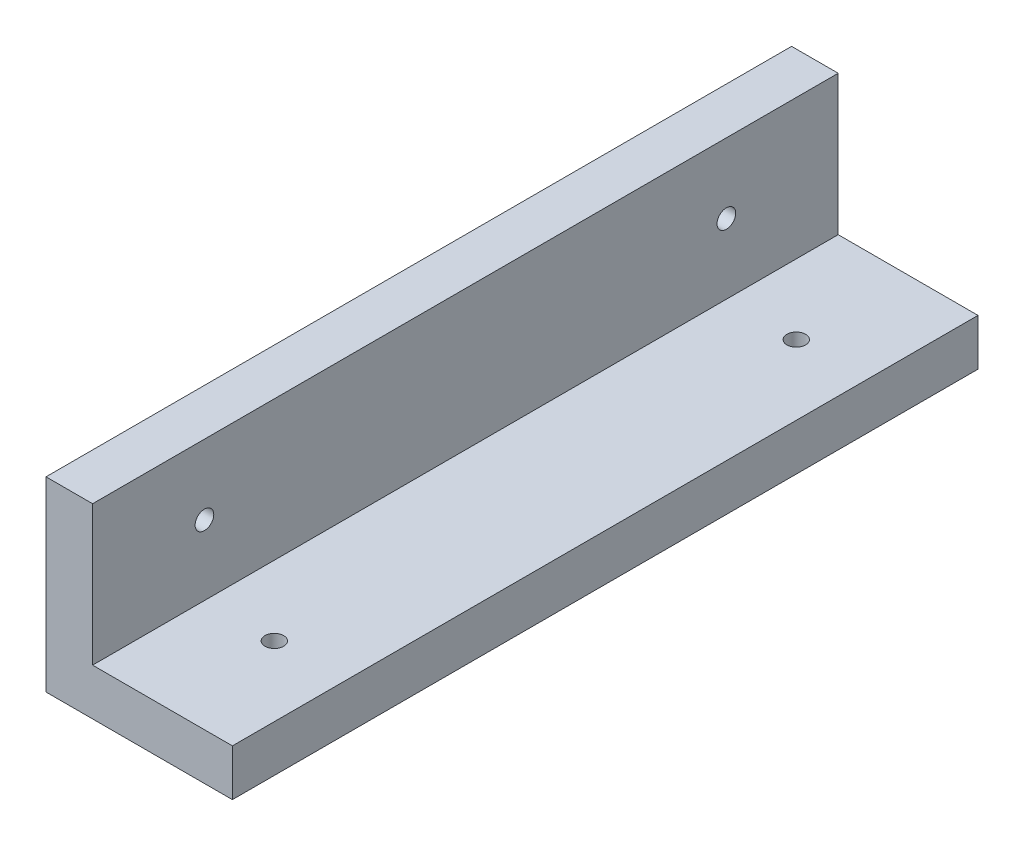
ISO-10303-21;
HEADER;
FILE_DESCRIPTION(('STEP AP214'),'2;1');
FILE_NAME('part.step','',(''),(''),'','','');
FILE_SCHEMA(('AUTOMOTIVE_DESIGN { 1 0 10303 214 1 1 1 1 }'));
ENDSEC;
DATA;
#1=APPLICATION_CONTEXT('core data for automotive mechanical design processes');
#2=APPLICATION_PROTOCOL_DEFINITION('international standard','automotive_design',2000,#1);
#3=PRODUCT_CONTEXT('',#1,'mechanical');
#4=PRODUCT('Part','Part','',(#3));
#5=PRODUCT_RELATED_PRODUCT_CATEGORY('part','',(#4));
#6=PRODUCT_DEFINITION_FORMATION('','',#4);
#7=PRODUCT_DEFINITION_CONTEXT('part definition',#1,'design');
#8=PRODUCT_DEFINITION('design','',#6,#7);
#9=PRODUCT_DEFINITION_SHAPE('','',#8);
#10=(LENGTH_UNIT() NAMED_UNIT(*) SI_UNIT(.MILLI.,.METRE.));
#11=(NAMED_UNIT(*) PLANE_ANGLE_UNIT() SI_UNIT($,.RADIAN.));
#12=(NAMED_UNIT(*) SI_UNIT($,.STERADIAN.) SOLID_ANGLE_UNIT());
#13=UNCERTAINTY_MEASURE_WITH_UNIT(LENGTH_MEASURE(1.E-05),#10,'distance_accuracy_value','');
#14=(GEOMETRIC_REPRESENTATION_CONTEXT(3) GLOBAL_UNCERTAINTY_ASSIGNED_CONTEXT((#13)) GLOBAL_UNIT_ASSIGNED_CONTEXT((#10,
#11,#12)) REPRESENTATION_CONTEXT('',''));
#15=CARTESIAN_POINT('',(0.,0.,0.));
#16=DIRECTION('',(0.,0.,1.));
#17=DIRECTION('',(1.,0.,0.));
#18=AXIS2_PLACEMENT_3D('',#15,#16,#17);
#19=CARTESIAN_POINT('',(5.,20.,80.));
#20=DIRECTION('',(-1.,0.,0.));
#21=DIRECTION('',(0.,-1.,0.));
#22=AXIS2_PLACEMENT_3D('',#19,#20,#21);
#23=PLANE('',#22);
#24=CARTESIAN_POINT('',(5.,12.5,12.));
#25=DIRECTION('',(-1.,0.,0.));
#26=DIRECTION('',(0.,-1.,0.));
#27=AXIS2_PLACEMENT_3D('',#24,#25,#26);
#28=CIRCLE('',#27,1.);
#29=CARTESIAN_POINT('',(5.,11.5,12.));
#30=VERTEX_POINT('',#29);
#31=EDGE_CURVE('E143',#30,#30,#28,.F.);
#32=ORIENTED_EDGE('',*,*,#31,.F.);
#33=EDGE_LOOP('',(#32));
#34=FACE_BOUND('',#33,.T.);
#35=DIRECTION('',(0.,1.,0.));
#36=VECTOR('',#35,1.);
#37=CARTESIAN_POINT('',(5.,20.,0.));
#38=LINE('',#37,#36);
#39=CARTESIAN_POINT('',(5.,5.,0.));
#40=VERTEX_POINT('',#39);
#41=CARTESIAN_POINT('',(5.,20.,0.));
#42=VERTEX_POINT('',#41);
#43=EDGE_CURVE('E110',#40,#42,#38,.T.);
#44=ORIENTED_EDGE('',*,*,#43,.T.);
#45=DIRECTION('',(0.,0.,-1.));
#46=VECTOR('',#45,1.);
#47=CARTESIAN_POINT('',(5.,20.,80.));
#48=LINE('',#47,#46);
#49=CARTESIAN_POINT('',(5.,20.,80.));
#50=VERTEX_POINT('',#49);
#51=EDGE_CURVE('E107',#50,#42,#48,.T.);
#52=ORIENTED_EDGE('',*,*,#51,.F.);
#53=DIRECTION('',(0.,1.,0.));
#54=VECTOR('',#53,1.);
#55=CARTESIAN_POINT('',(5.,20.,80.));
#56=LINE('',#55,#54);
#57=CARTESIAN_POINT('',(5.,5.,80.));
#58=VERTEX_POINT('',#57);
#59=EDGE_CURVE('E96',#58,#50,#56,.T.);
#60=ORIENTED_EDGE('',*,*,#59,.F.);
#61=DIRECTION('',(0.,0.,-1.));
#62=VECTOR('',#61,1.);
#63=CARTESIAN_POINT('',(5.,5.,80.));
#64=LINE('',#63,#62);
#65=EDGE_CURVE('E111',#58,#40,#64,.T.);
#66=ORIENTED_EDGE('',*,*,#65,.T.);
#67=EDGE_LOOP('',(#44,#52,#60,#66));
#68=FACE_BOUND('',#67,.T.);
#69=CARTESIAN_POINT('',(5.,12.5,68.));
#70=DIRECTION('',(-1.,0.,0.));
#71=DIRECTION('',(0.,-1.,0.));
#72=AXIS2_PLACEMENT_3D('',#69,#70,#71);
#73=CIRCLE('',#72,0.999999999999998);
#74=CARTESIAN_POINT('',(5.,11.5,68.));
#75=VERTEX_POINT('',#74);
#76=EDGE_CURVE('E146',#75,#75,#73,.F.);
#77=ORIENTED_EDGE('',*,*,#76,.F.);
#78=EDGE_LOOP('',(#77));
#79=FACE_BOUND('',#78,.T.);
#80=ADVANCED_FACE('F33',(#34,#68,#79),#23,.F.);
#81=CARTESIAN_POINT('',(0.,0.,80.));
#82=DIRECTION('',(1.,0.,0.));
#83=DIRECTION('',(0.,0.,-1.));
#84=AXIS2_PLACEMENT_3D('',#81,#82,#83);
#85=PLANE('',#84);
#86=CARTESIAN_POINT('',(0.,12.5,12.));
#87=DIRECTION('',(1.,0.,0.));
#88=DIRECTION('',(0.,0.,-1.));
#89=AXIS2_PLACEMENT_3D('',#86,#87,#88);
#90=CIRCLE('',#89,1.);
#91=CARTESIAN_POINT('',(0.,12.5,11.));
#92=VERTEX_POINT('',#91);
#93=EDGE_CURVE('E144',#92,#92,#90,.F.);
#94=ORIENTED_EDGE('',*,*,#93,.F.);
#95=EDGE_LOOP('',(#94));
#96=FACE_BOUND('',#95,.T.);
#97=DIRECTION('',(0.,-1.,0.));
#98=VECTOR('',#97,1.);
#99=CARTESIAN_POINT('',(0.,0.,0.));
#100=LINE('',#99,#98);
#101=CARTESIAN_POINT('',(0.,20.,0.));
#102=VERTEX_POINT('',#101);
#103=CARTESIAN_POINT('',(0.,0.,0.));
#104=VERTEX_POINT('',#103);
#105=EDGE_CURVE('E81',#102,#104,#100,.T.);
#106=ORIENTED_EDGE('',*,*,#105,.T.);
#107=DIRECTION('',(0.,0.,-1.));
#108=VECTOR('',#107,1.);
#109=CARTESIAN_POINT('',(0.,0.,80.));
#110=LINE('',#109,#108);
#111=CARTESIAN_POINT('',(0.,0.,80.));
#112=VERTEX_POINT('',#111);
#113=EDGE_CURVE('E116',#112,#104,#110,.T.);
#114=ORIENTED_EDGE('',*,*,#113,.F.);
#115=DIRECTION('',(0.,-1.,0.));
#116=VECTOR('',#115,1.);
#117=CARTESIAN_POINT('',(0.,0.,80.));
#118=LINE('',#117,#116);
#119=CARTESIAN_POINT('',(0.,20.,80.));
#120=VERTEX_POINT('',#119);
#121=EDGE_CURVE('E52',#120,#112,#118,.T.);
#122=ORIENTED_EDGE('',*,*,#121,.F.);
#123=DIRECTION('',(0.,0.,-1.));
#124=VECTOR('',#123,1.);
#125=CARTESIAN_POINT('',(0.,20.,80.));
#126=LINE('',#125,#124);
#127=EDGE_CURVE('E112',#120,#102,#126,.T.);
#128=ORIENTED_EDGE('',*,*,#127,.T.);
#129=EDGE_LOOP('',(#106,#114,#122,#128));
#130=FACE_BOUND('',#129,.T.);
#131=CARTESIAN_POINT('',(0.,12.5,68.));
#132=DIRECTION('',(1.,0.,0.));
#133=DIRECTION('',(0.,0.,-1.));
#134=AXIS2_PLACEMENT_3D('',#131,#132,#133);
#135=CIRCLE('',#134,0.999999999999998);
#136=CARTESIAN_POINT('',(0.,12.5,67.));
#137=VERTEX_POINT('',#136);
#138=EDGE_CURVE('E37',#137,#137,#135,.F.);
#139=ORIENTED_EDGE('',*,*,#138,.F.);
#140=EDGE_LOOP('',(#139));
#141=FACE_BOUND('',#140,.T.);
#142=ADVANCED_FACE('F174',(#96,#130,#141),#85,.F.);
#143=CARTESIAN_POINT('',(0.,0.,80.));
#144=DIRECTION('',(0.,1.,0.));
#145=DIRECTION('',(0.,0.,1.));
#146=AXIS2_PLACEMENT_3D('',#143,#144,#145);
#147=PLANE('',#146);
#148=CARTESIAN_POINT('',(12.5,0.,12.));
#149=DIRECTION('',(0.,1.,0.));
#150=DIRECTION('',(0.,0.,1.));
#151=AXIS2_PLACEMENT_3D('',#148,#149,#150);
#152=CIRCLE('',#151,1.);
#153=CARTESIAN_POINT('',(12.5,0.,13.));
#154=VERTEX_POINT('',#153);
#155=EDGE_CURVE('E124',#154,#154,#152,.F.);
#156=ORIENTED_EDGE('',*,*,#155,.F.);
#157=EDGE_LOOP('',(#156));
#158=FACE_BOUND('',#157,.T.);
#159=DIRECTION('',(1.,0.,0.));
#160=VECTOR('',#159,1.);
#161=CARTESIAN_POINT('',(0.,0.,0.));
#162=LINE('',#161,#160);
#163=CARTESIAN_POINT('',(20.,0.,0.));
#164=VERTEX_POINT('',#163);
#165=EDGE_CURVE('E120',#104,#164,#162,.T.);
#166=ORIENTED_EDGE('',*,*,#165,.T.);
#167=DIRECTION('',(0.,0.,-1.));
#168=VECTOR('',#167,1.);
#169=CARTESIAN_POINT('',(20.,0.,80.));
#170=LINE('',#169,#168);
#171=CARTESIAN_POINT('',(20.,0.,80.));
#172=VERTEX_POINT('',#171);
#173=EDGE_CURVE('E11',#172,#164,#170,.T.);
#174=ORIENTED_EDGE('',*,*,#173,.F.);
#175=DIRECTION('',(1.,0.,0.));
#176=VECTOR('',#175,1.);
#177=CARTESIAN_POINT('',(0.,0.,80.));
#178=LINE('',#177,#176);
#179=EDGE_CURVE('E131',#112,#172,#178,.T.);
#180=ORIENTED_EDGE('',*,*,#179,.F.);
#181=ORIENTED_EDGE('',*,*,#113,.T.);
#182=EDGE_LOOP('',(#166,#174,#180,#181));
#183=FACE_BOUND('',#182,.T.);
#184=CARTESIAN_POINT('',(12.5,0.,68.));
#185=DIRECTION('',(0.,1.,0.));
#186=DIRECTION('',(0.,0.,1.));
#187=AXIS2_PLACEMENT_3D('',#184,#185,#186);
#188=CIRCLE('',#187,1.);
#189=CARTESIAN_POINT('',(12.5,0.,69.));
#190=VERTEX_POINT('',#189);
#191=EDGE_CURVE('E140',#190,#190,#188,.F.);
#192=ORIENTED_EDGE('',*,*,#191,.F.);
#193=EDGE_LOOP('',(#192));
#194=FACE_BOUND('',#193,.T.);
#195=ADVANCED_FACE('F35',(#158,#183,#194),#147,.F.);
#196=CARTESIAN_POINT('',(5.,5.,80.));
#197=DIRECTION('',(0.,-1.,0.));
#198=DIRECTION('',(0.,0.,-1.));
#199=AXIS2_PLACEMENT_3D('',#196,#197,#198);
#200=PLANE('',#199);
#201=CARTESIAN_POINT('',(12.5,5.,12.));
#202=DIRECTION('',(0.,-1.,0.));
#203=DIRECTION('',(0.,0.,-1.));
#204=AXIS2_PLACEMENT_3D('',#201,#202,#203);
#205=CIRCLE('',#204,1.);
#206=CARTESIAN_POINT('',(12.5,5.,11.));
#207=VERTEX_POINT('',#206);
#208=EDGE_CURVE('E137',#207,#207,#205,.F.);
#209=ORIENTED_EDGE('',*,*,#208,.F.);
#210=EDGE_LOOP('',(#209));
#211=FACE_BOUND('',#210,.T.);
#212=DIRECTION('',(-1.,0.,0.));
#213=VECTOR('',#212,1.);
#214=CARTESIAN_POINT('',(5.,5.,0.));
#215=LINE('',#214,#213);
#216=CARTESIAN_POINT('',(20.,5.,0.));
#217=VERTEX_POINT('',#216);
#218=EDGE_CURVE('E126',#217,#40,#215,.T.);
#219=ORIENTED_EDGE('',*,*,#218,.T.);
#220=ORIENTED_EDGE('',*,*,#65,.F.);
#221=DIRECTION('',(-1.,0.,0.));
#222=VECTOR('',#221,1.);
#223=CARTESIAN_POINT('',(5.,5.,80.));
#224=LINE('',#223,#222);
#225=CARTESIAN_POINT('',(20.,5.,80.));
#226=VERTEX_POINT('',#225);
#227=EDGE_CURVE('E102',#226,#58,#224,.T.);
#228=ORIENTED_EDGE('',*,*,#227,.F.);
#229=DIRECTION('',(0.,0.,-1.));
#230=VECTOR('',#229,1.);
#231=CARTESIAN_POINT('',(20.,5.,80.));
#232=LINE('',#231,#230);
#233=EDGE_CURVE('E43',#226,#217,#232,.T.);
#234=ORIENTED_EDGE('',*,*,#233,.T.);
#235=EDGE_LOOP('',(#219,#220,#228,#234));
#236=FACE_BOUND('',#235,.T.);
#237=CARTESIAN_POINT('',(12.5,5.,68.));
#238=DIRECTION('',(0.,-1.,0.));
#239=DIRECTION('',(0.,0.,-1.));
#240=AXIS2_PLACEMENT_3D('',#237,#238,#239);
#241=CIRCLE('',#240,1.);
#242=CARTESIAN_POINT('',(12.5,5.,67.));
#243=VERTEX_POINT('',#242);
#244=EDGE_CURVE('E141',#243,#243,#241,.F.);
#245=ORIENTED_EDGE('',*,*,#244,.F.);
#246=EDGE_LOOP('',(#245));
#247=FACE_BOUND('',#246,.T.);
#248=ADVANCED_FACE('F167',(#211,#236,#247),#200,.F.);
#249=CARTESIAN_POINT('',(20.,5.,80.));
#250=DIRECTION('',(-1.,0.,0.));
#251=DIRECTION('',(0.,0.,1.));
#252=AXIS2_PLACEMENT_3D('',#249,#250,#251);
#253=PLANE('',#252);
#254=DIRECTION('',(0.,1.,0.));
#255=VECTOR('',#254,1.);
#256=CARTESIAN_POINT('',(20.,5.,0.));
#257=LINE('',#256,#255);
#258=EDGE_CURVE('E123',#164,#217,#257,.T.);
#259=ORIENTED_EDGE('',*,*,#258,.T.);
#260=ORIENTED_EDGE('',*,*,#233,.F.);
#261=DIRECTION('',(0.,1.,0.));
#262=VECTOR('',#261,1.);
#263=CARTESIAN_POINT('',(20.,5.,80.));
#264=LINE('',#263,#262);
#265=EDGE_CURVE('E89',#172,#226,#264,.T.);
#266=ORIENTED_EDGE('',*,*,#265,.F.);
#267=ORIENTED_EDGE('',*,*,#173,.T.);
#268=EDGE_LOOP('',(#259,#260,#266,#267));
#269=FACE_BOUND('',#268,.T.);
#270=ADVANCED_FACE('F164',(#269),#253,.F.);
#271=CARTESIAN_POINT('',(0.,20.,80.));
#272=DIRECTION('',(0.,-1.,0.));
#273=DIRECTION('',(0.,0.,-1.));
#274=AXIS2_PLACEMENT_3D('',#271,#272,#273);
#275=PLANE('',#274);
#276=DIRECTION('',(-1.,0.,0.));
#277=VECTOR('',#276,1.);
#278=CARTESIAN_POINT('',(0.,20.,0.));
#279=LINE('',#278,#277);
#280=EDGE_CURVE('E75',#42,#102,#279,.T.);
#281=ORIENTED_EDGE('',*,*,#280,.T.);
#282=ORIENTED_EDGE('',*,*,#127,.F.);
#283=DIRECTION('',(-1.,0.,0.));
#284=VECTOR('',#283,1.);
#285=CARTESIAN_POINT('',(0.,20.,80.));
#286=LINE('',#285,#284);
#287=EDGE_CURVE('E100',#50,#120,#286,.T.);
#288=ORIENTED_EDGE('',*,*,#287,.F.);
#289=ORIENTED_EDGE('',*,*,#51,.T.);
#290=EDGE_LOOP('',(#281,#282,#288,#289));
#291=FACE_BOUND('',#290,.T.);
#292=ADVANCED_FACE('F114',(#291),#275,.F.);
#293=CARTESIAN_POINT('',(0.,0.,80.));
#294=DIRECTION('',(0.,0.,-1.));
#295=DIRECTION('',(-1.,0.,0.));
#296=AXIS2_PLACEMENT_3D('',#293,#294,#295);
#297=PLANE('',#296);
#298=ORIENTED_EDGE('',*,*,#179,.T.);
#299=ORIENTED_EDGE('',*,*,#265,.T.);
#300=ORIENTED_EDGE('',*,*,#227,.T.);
#301=ORIENTED_EDGE('',*,*,#59,.T.);
#302=ORIENTED_EDGE('',*,*,#287,.T.);
#303=ORIENTED_EDGE('',*,*,#121,.T.);
#304=EDGE_LOOP('',(#298,#299,#300,#301,#302,#303));
#305=FACE_BOUND('',#304,.T.);
#306=ADVANCED_FACE('F98',(#305),#297,.F.);
#307=CARTESIAN_POINT('',(0.,0.,0.));
#308=DIRECTION('',(0.,0.,-1.));
#309=DIRECTION('',(-1.,0.,0.));
#310=AXIS2_PLACEMENT_3D('',#307,#308,#309);
#311=PLANE('',#310);
#312=ORIENTED_EDGE('',*,*,#165,.F.);
#313=ORIENTED_EDGE('',*,*,#105,.F.);
#314=ORIENTED_EDGE('',*,*,#280,.F.);
#315=ORIENTED_EDGE('',*,*,#43,.F.);
#316=ORIENTED_EDGE('',*,*,#218,.F.);
#317=ORIENTED_EDGE('',*,*,#258,.F.);
#318=EDGE_LOOP('',(#312,#313,#314,#315,#316,#317));
#319=FACE_BOUND('',#318,.T.);
#320=ADVANCED_FACE('F171',(#319),#311,.T.);
#321=CARTESIAN_POINT('',(12.5,10.,12.));
#322=DIRECTION('',(0.,-1.,0.));
#323=DIRECTION('',(0.,0.,-1.));
#324=AXIS2_PLACEMENT_3D('',#321,#322,#323);
#325=CYLINDRICAL_SURFACE('',#324,1.);
#326=ORIENTED_EDGE('',*,*,#208,.T.);
#327=EDGE_LOOP('',(#326));
#328=FACE_BOUND('',#327,.T.);
#329=ORIENTED_EDGE('',*,*,#155,.T.);
#330=EDGE_LOOP('',(#329));
#331=FACE_BOUND('',#330,.T.);
#332=ADVANCED_FACE('F211',(#328,#331),#325,.F.);
#333=CARTESIAN_POINT('',(12.5,10.,68.));
#334=DIRECTION('',(0.,-1.,0.));
#335=DIRECTION('',(0.,0.,-1.));
#336=AXIS2_PLACEMENT_3D('',#333,#334,#335);
#337=CYLINDRICAL_SURFACE('',#336,1.);
#338=ORIENTED_EDGE('',*,*,#244,.T.);
#339=EDGE_LOOP('',(#338));
#340=FACE_BOUND('',#339,.T.);
#341=ORIENTED_EDGE('',*,*,#191,.T.);
#342=EDGE_LOOP('',(#341));
#343=FACE_BOUND('',#342,.T.);
#344=ADVANCED_FACE('F188',(#340,#343),#337,.F.);
#345=CARTESIAN_POINT('',(10.,12.5,12.));
#346=DIRECTION('',(-1.,0.,0.));
#347=DIRECTION('',(0.,0.,1.));
#348=AXIS2_PLACEMENT_3D('',#345,#346,#347);
#349=CYLINDRICAL_SURFACE('',#348,1.);
#350=ORIENTED_EDGE('',*,*,#93,.T.);
#351=EDGE_LOOP('',(#350));
#352=FACE_BOUND('',#351,.T.);
#353=ORIENTED_EDGE('',*,*,#31,.T.);
#354=EDGE_LOOP('',(#353));
#355=FACE_BOUND('',#354,.T.);
#356=ADVANCED_FACE('F183',(#352,#355),#349,.F.);
#357=CARTESIAN_POINT('',(10.,12.5,68.));
#358=DIRECTION('',(-1.,0.,0.));
#359=DIRECTION('',(0.,0.,1.));
#360=AXIS2_PLACEMENT_3D('',#357,#358,#359);
#361=CYLINDRICAL_SURFACE('',#360,0.999999999999998);
#362=ORIENTED_EDGE('',*,*,#138,.T.);
#363=EDGE_LOOP('',(#362));
#364=FACE_BOUND('',#363,.T.);
#365=ORIENTED_EDGE('',*,*,#76,.T.);
#366=EDGE_LOOP('',(#365));
#367=FACE_BOUND('',#366,.T.);
#368=ADVANCED_FACE('F181',(#364,#367),#361,.F.);
#369=CLOSED_SHELL('',(#80,#142,#195,#248,#270,#292,#306,#320,#332,#344,#356,#368));
#370=MANIFOLD_SOLID_BREP('B2',#369);
#371=ADVANCED_BREP_SHAPE_REPRESENTATION('',(#18,#370),#14);
#372=SHAPE_DEFINITION_REPRESENTATION(#9,#371);
ENDSEC;
END-ISO-10303-21;
